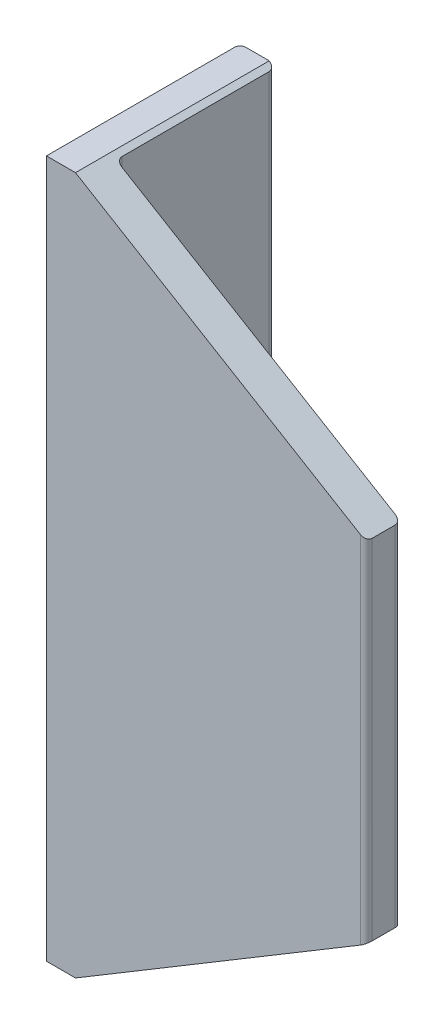
ISO-10303-21;
HEADER;
FILE_DESCRIPTION(('STEP AP214'),'2;1');
FILE_NAME('part.step','',(''),(''),'','','');
FILE_SCHEMA(('AUTOMOTIVE_DESIGN { 1 0 10303 214 1 1 1 1 }'));
ENDSEC;
DATA;
#1=APPLICATION_CONTEXT('core data for automotive mechanical design processes');
#2=APPLICATION_PROTOCOL_DEFINITION('international standard','automotive_design',2000,#1);
#3=PRODUCT_CONTEXT('',#1,'mechanical');
#4=PRODUCT('Part','Part','',(#3));
#5=PRODUCT_RELATED_PRODUCT_CATEGORY('part','',(#4));
#6=PRODUCT_DEFINITION_FORMATION('','',#4);
#7=PRODUCT_DEFINITION_CONTEXT('part definition',#1,'design');
#8=PRODUCT_DEFINITION('design','',#6,#7);
#9=PRODUCT_DEFINITION_SHAPE('','',#8);
#10=(LENGTH_UNIT() NAMED_UNIT(*) SI_UNIT(.MILLI.,.METRE.));
#11=(NAMED_UNIT(*) PLANE_ANGLE_UNIT() SI_UNIT($,.RADIAN.));
#12=(NAMED_UNIT(*) SI_UNIT($,.STERADIAN.) SOLID_ANGLE_UNIT());
#13=UNCERTAINTY_MEASURE_WITH_UNIT(LENGTH_MEASURE(1.E-05),#10,'distance_accuracy_value','');
#14=(GEOMETRIC_REPRESENTATION_CONTEXT(3) GLOBAL_UNCERTAINTY_ASSIGNED_CONTEXT((#13)) GLOBAL_UNIT_ASSIGNED_CONTEXT((#10,
#11,#12)) REPRESENTATION_CONTEXT('',''));
#15=CARTESIAN_POINT('',(0.,0.,0.));
#16=DIRECTION('',(0.,0.,1.));
#17=DIRECTION('',(1.,0.,0.));
#18=AXIS2_PLACEMENT_3D('',#15,#16,#17);
#19=CARTESIAN_POINT('',(-54.0165804389298,510.000098304883,19.1457703649463));
#20=DIRECTION('',(0.,0.,1.));
#21=DIRECTION('',(1.,0.,0.));
#22=AXIS2_PLACEMENT_3D('',#19,#20,#21);
#23=PLANE('',#22);
#24=DIRECTION('',(0.,-1.,0.));
#25=VECTOR('',#24,1.);
#26=CARTESIAN_POINT('',(298.48341956107,510.000098304883,19.1457703649463));
#27=LINE('',#26,#25);
#28=CARTESIAN_POINT('',(298.48341956107,37.5000983048829,19.1457703649463));
#29=VERTEX_POINT('',#28);
#30=CARTESIAN_POINT('',(298.48341956107,-169.499901695117,19.1457703649463));
#31=VERTEX_POINT('',#30);
#32=EDGE_CURVE('E212',#29,#31,#27,.T.);
#33=ORIENTED_EDGE('',*,*,#32,.T.);
#34=DIRECTION('',(-0.857492925712544,-0.514495755427526,0.));
#35=VECTOR('',#34,1.);
#36=CARTESIAN_POINT('',(339.071654855188,-145.146960518647,19.1457703649463));
#37=LINE('',#36,#35);
#38=CARTESIAN_POINT('',(-54.0165804389298,-380.999901695117,19.1457703649463));
#39=VERTEX_POINT('',#38);
#40=EDGE_CURVE('E238',#31,#39,#37,.T.);
#41=ORIENTED_EDGE('',*,*,#40,.T.);
#42=DIRECTION('',(0.,-1.,0.));
#43=VECTOR('',#42,1.);
#44=CARTESIAN_POINT('',(-54.0165804389298,510.000098304883,19.1457703649463));
#45=LINE('',#44,#43);
#46=CARTESIAN_POINT('',(-54.0165804389298,37.5000983048829,19.1457703649463));
#47=VERTEX_POINT('',#46);
#48=EDGE_CURVE('E209',#47,#39,#45,.T.);
#49=ORIENTED_EDGE('',*,*,#48,.F.);
#50=DIRECTION('',(-1.,0.,0.));
#51=VECTOR('',#50,1.);
#52=CARTESIAN_POINT('',(-54.0165804389298,37.5000983048829,19.1457703649463));
#53=LINE('',#52,#51);
#54=EDGE_CURVE('E267',#29,#47,#53,.T.);
#55=ORIENTED_EDGE('',*,*,#54,.F.);
#56=EDGE_LOOP('',(#33,#41,#49,#55));
#57=FACE_BOUND('',#56,.T.);
#58=ADVANCED_FACE('F39',(#57),#23,.F.);
#59=CARTESIAN_POINT('',(-54.0165804389298,510.000098304883,11.6457703649463));
#60=DIRECTION('',(0.,-1.,0.));
#61=DIRECTION('',(0.,0.,-1.));
#62=AXIS2_PLACEMENT_3D('',#59,#60,#61);
#63=CYLINDRICAL_SURFACE('',#62,7.5);
#64=ORIENTED_EDGE('',*,*,#48,.T.);
#65=CARTESIAN_POINT('',(-54.0165804389298,-380.999901695117,11.6457703649463));
#66=DIRECTION('',(-0.514495755427526,0.857492925712544,0.));
#67=DIRECTION('',(-0.857492925712544,-0.514495755427526,0.));
#68=AXIS2_PLACEMENT_3D('',#65,#66,#67);
#69=ELLIPSE('',#68,8.74642784226795,7.5);
#70=CARTESIAN_POINT('',(-61.5165804389298,-385.499901695117,11.6457703649463));
#71=VERTEX_POINT('',#70);
#72=EDGE_CURVE('E306',#39,#71,#69,.F.);
#73=ORIENTED_EDGE('',*,*,#72,.T.);
#74=DIRECTION('',(0.,-1.,0.));
#75=VECTOR('',#74,1.);
#76=CARTESIAN_POINT('',(-61.5165804389298,510.000098304883,11.6457703649463));
#77=LINE('',#76,#75);
#78=CARTESIAN_POINT('',(-61.5165804389298,37.5000983048829,11.6457703649463));
#79=VERTEX_POINT('',#78);
#80=EDGE_CURVE('E206',#79,#71,#77,.T.);
#81=ORIENTED_EDGE('',*,*,#80,.F.);
#82=CARTESIAN_POINT('',(-54.0165804389298,37.5000983048829,11.6457703649463));
#83=DIRECTION('',(0.,1.,0.));
#84=DIRECTION('',(0.,0.,1.));
#85=AXIS2_PLACEMENT_3D('',#82,#83,#84);
#86=CIRCLE('',#85,7.5);
#87=EDGE_CURVE('E265',#47,#79,#86,.F.);
#88=ORIENTED_EDGE('',*,*,#87,.F.);
#89=EDGE_LOOP('',(#64,#73,#81,#88));
#90=FACE_BOUND('',#89,.T.);
#91=ADVANCED_FACE('F317',(#90),#63,.F.);
#92=CARTESIAN_POINT('',(-61.5165804389299,510.000098304883,-178.354229635054));
#93=DIRECTION('',(-1.,0.,0.));
#94=DIRECTION('',(0.,0.,1.));
#95=AXIS2_PLACEMENT_3D('',#92,#93,#94);
#96=PLANE('',#95);
#97=ORIENTED_EDGE('',*,*,#80,.T.);
#98=DIRECTION('',(0.,0.,-1.));
#99=VECTOR('',#98,1.);
#100=CARTESIAN_POINT('',(-61.5165804389299,-385.499901695117,-178.354229635054));
#101=LINE('',#100,#99);
#102=CARTESIAN_POINT('',(-61.5165804389299,-385.499901695117,-178.354229635054));
#103=VERTEX_POINT('',#102);
#104=EDGE_CURVE('E172',#71,#103,#101,.T.);
#105=ORIENTED_EDGE('',*,*,#104,.T.);
#106=DIRECTION('',(0.,-1.,0.));
#107=VECTOR('',#106,1.);
#108=CARTESIAN_POINT('',(-61.5165804389299,510.000098304883,-178.354229635054));
#109=LINE('',#108,#107);
#110=CARTESIAN_POINT('',(-61.5165804389299,37.5000983048829,-178.354229635054));
#111=VERTEX_POINT('',#110);
#112=EDGE_CURVE('E171',#111,#103,#109,.T.);
#113=ORIENTED_EDGE('',*,*,#112,.F.);
#114=DIRECTION('',(0.,0.,-1.));
#115=VECTOR('',#114,1.);
#116=CARTESIAN_POINT('',(-61.5165804389299,37.5000983048829,-178.354229635054));
#117=LINE('',#116,#115);
#118=EDGE_CURVE('E262',#79,#111,#117,.T.);
#119=ORIENTED_EDGE('',*,*,#118,.F.);
#120=EDGE_LOOP('',(#97,#105,#113,#119));
#121=FACE_BOUND('',#120,.T.);
#122=ADVANCED_FACE('F324',(#121),#96,.F.);
#123=CARTESIAN_POINT('',(298.48341956107,510.000098304883,64.1457703649463));
#124=DIRECTION('',(0.,0.,-1.));
#125=DIRECTION('',(-1.,0.,0.));
#126=AXIS2_PLACEMENT_3D('',#123,#124,#125);
#127=PLANE('',#126);
#128=DIRECTION('',(1.,0.,0.));
#129=VECTOR('',#128,1.);
#130=CARTESIAN_POINT('',(298.48341956107,-389.999901695117,64.1457703649463));
#131=LINE('',#130,#129);
#132=CARTESIAN_POINT('',(-106.51658043893,-389.999901695117,64.1457703649463));
#133=VERTEX_POINT('',#132);
#134=CARTESIAN_POINT('',(-69.0165804389299,-389.999901695117,64.1457703649463));
#135=VERTEX_POINT('',#134);
#136=EDGE_CURVE('E187',#133,#135,#131,.T.);
#137=ORIENTED_EDGE('',*,*,#136,.T.);
#138=DIRECTION('',(-0.857492925712544,-0.514495755427526,0.));
#139=VECTOR('',#138,1.);
#140=CARTESIAN_POINT('',(-69.0165804389299,-389.999901695117,64.1457703649463));
#141=LINE('',#140,#139);
#142=CARTESIAN_POINT('',(298.48341956107,-169.499901695117,64.1457703649463));
#143=VERTEX_POINT('',#142);
#144=EDGE_CURVE('E54',#143,#135,#141,.T.);
#145=ORIENTED_EDGE('',*,*,#144,.F.);
#146=DIRECTION('',(0.,-1.,0.));
#147=VECTOR('',#146,1.);
#148=CARTESIAN_POINT('',(298.48341956107,510.000098304883,64.1457703649463));
#149=LINE('',#148,#147);
#150=CARTESIAN_POINT('',(298.48341956107,289.500098304883,64.1457703649463));
#151=VERTEX_POINT('',#150);
#152=EDGE_CURVE('E11',#151,#143,#149,.T.);
#153=ORIENTED_EDGE('',*,*,#152,.F.);
#154=DIRECTION('',(0.857492925712544,-0.514495755427526,0.));
#155=VECTOR('',#154,1.);
#156=CARTESIAN_POINT('',(-69.0165804389299,510.000098304883,64.1457703649463));
#157=LINE('',#156,#155);
#158=CARTESIAN_POINT('',(-69.0165804389299,510.000098304883,64.1457703649463));
#159=VERTEX_POINT('',#158);
#160=EDGE_CURVE('E232',#159,#151,#157,.T.);
#161=ORIENTED_EDGE('',*,*,#160,.F.);
#162=DIRECTION('',(1.,0.,0.));
#163=VECTOR('',#162,1.);
#164=CARTESIAN_POINT('',(298.48341956107,510.000098304883,64.1457703649463));
#165=LINE('',#164,#163);
#166=CARTESIAN_POINT('',(-106.51658043893,510.000098304883,64.1457703649463));
#167=VERTEX_POINT('',#166);
#168=EDGE_CURVE('E197',#167,#159,#165,.T.);
#169=ORIENTED_EDGE('',*,*,#168,.F.);
#170=DIRECTION('',(0.,-1.,0.));
#171=VECTOR('',#170,1.);
#172=CARTESIAN_POINT('',(-106.51658043893,510.000098304883,64.1457703649463));
#173=LINE('',#172,#171);
#174=EDGE_CURVE('E198',#167,#133,#173,.T.);
#175=ORIENTED_EDGE('',*,*,#174,.T.);
#176=EDGE_LOOP('',(#137,#145,#153,#161,#169,#175));
#177=FACE_BOUND('',#176,.T.);
#178=ADVANCED_FACE('F41',(#177),#127,.F.);
#179=CARTESIAN_POINT('',(298.48341956107,510.000098304883,56.6457703649463));
#180=DIRECTION('',(0.,-1.,0.));
#181=DIRECTION('',(0.,0.,-1.));
#182=AXIS2_PLACEMENT_3D('',#179,#180,#181);
#183=CYLINDRICAL_SURFACE('',#182,7.5);
#184=ORIENTED_EDGE('',*,*,#152,.T.);
#185=CARTESIAN_POINT('',(298.48341956107,-169.499901695117,56.6457703649463));
#186=DIRECTION('',(-0.514495755427526,0.857492925712544,0.));
#187=DIRECTION('',(-0.857492925712544,-0.514495755427526,0.));
#188=AXIS2_PLACEMENT_3D('',#185,#186,#187);
#189=ELLIPSE('',#188,8.74642784226795,7.5);
#190=CARTESIAN_POINT('',(305.98341956107,-164.999901695117,56.6457703649463));
#191=VERTEX_POINT('',#190);
#192=EDGE_CURVE('E231',#143,#191,#189,.T.);
#193=ORIENTED_EDGE('',*,*,#192,.T.);
#194=DIRECTION('',(0.,-1.,0.));
#195=VECTOR('',#194,1.);
#196=CARTESIAN_POINT('',(305.98341956107,510.000098304883,56.6457703649463));
#197=LINE('',#196,#195);
#198=CARTESIAN_POINT('',(305.98341956107,285.000098304883,56.6457703649463));
#199=VERTEX_POINT('',#198);
#200=EDGE_CURVE('E47',#199,#191,#197,.T.);
#201=ORIENTED_EDGE('',*,*,#200,.F.);
#202=CARTESIAN_POINT('',(298.48341956107,289.500098304883,56.6457703649463));
#203=DIRECTION('',(-0.514495755427526,-0.857492925712544,0.));
#204=DIRECTION('',(0.857492925712544,-0.514495755427526,0.));
#205=AXIS2_PLACEMENT_3D('',#202,#203,#204);
#206=ELLIPSE('',#205,8.74642784226795,7.5);
#207=EDGE_CURVE('E229',#199,#151,#206,.T.);
#208=ORIENTED_EDGE('',*,*,#207,.T.);
#209=EDGE_LOOP('',(#184,#193,#201,#208));
#210=FACE_BOUND('',#209,.T.);
#211=ADVANCED_FACE('F228',(#210),#183,.T.);
#212=CARTESIAN_POINT('',(305.98341956107,510.000098304883,26.6457703649463));
#213=DIRECTION('',(-1.,0.,0.));
#214=DIRECTION('',(0.,0.,1.));
#215=AXIS2_PLACEMENT_3D('',#212,#213,#214);
#216=PLANE('',#215);
#217=ORIENTED_EDGE('',*,*,#200,.T.);
#218=DIRECTION('',(0.,0.,1.));
#219=VECTOR('',#218,1.);
#220=CARTESIAN_POINT('',(305.98341956107,-164.999901695117,-185.854229635054));
#221=LINE('',#220,#219);
#222=CARTESIAN_POINT('',(305.98341956107,-164.999901695117,26.6457703649463));
#223=VERTEX_POINT('',#222);
#224=EDGE_CURVE('E159',#223,#191,#221,.T.);
#225=ORIENTED_EDGE('',*,*,#224,.F.);
#226=DIRECTION('',(0.,-1.,0.));
#227=VECTOR('',#226,1.);
#228=CARTESIAN_POINT('',(305.98341956107,510.000098304883,26.6457703649463));
#229=LINE('',#228,#227);
#230=CARTESIAN_POINT('',(305.98341956107,285.000098304883,26.6457703649463));
#231=VERTEX_POINT('',#230);
#232=EDGE_CURVE('E215',#231,#223,#229,.T.);
#233=ORIENTED_EDGE('',*,*,#232,.F.);
#234=DIRECTION('',(0.,0.,1.));
#235=VECTOR('',#234,1.);
#236=CARTESIAN_POINT('',(305.98341956107,285.000098304883,-185.854229635054));
#237=LINE('',#236,#235);
#238=EDGE_CURVE('E224',#231,#199,#237,.T.);
#239=ORIENTED_EDGE('',*,*,#238,.T.);
#240=EDGE_LOOP('',(#217,#225,#233,#239));
#241=FACE_BOUND('',#240,.T.);
#242=ADVANCED_FACE('F222',(#241),#216,.F.);
#243=CARTESIAN_POINT('',(298.48341956107,510.000098304883,26.6457703649463));
#244=DIRECTION('',(0.,-1.,0.));
#245=DIRECTION('',(0.,0.,-1.));
#246=AXIS2_PLACEMENT_3D('',#243,#244,#245);
#247=CYLINDRICAL_SURFACE('',#246,7.5);
#248=ORIENTED_EDGE('',*,*,#232,.T.);
#249=CARTESIAN_POINT('',(298.48341956107,-169.499901695117,26.6457703649463));
#250=DIRECTION('',(-0.514495755427526,0.857492925712544,0.));
#251=DIRECTION('',(-0.857492925712544,-0.514495755427526,0.));
#252=AXIS2_PLACEMENT_3D('',#249,#250,#251);
#253=ELLIPSE('',#252,8.74642784226795,7.5);
#254=EDGE_CURVE('E233',#223,#31,#253,.T.);
#255=ORIENTED_EDGE('',*,*,#254,.T.);
#256=ORIENTED_EDGE('',*,*,#32,.F.);
#257=DIRECTION('',(0.,-1.,0.));
#258=VECTOR('',#257,1.);
#259=CARTESIAN_POINT('',(298.48341956107,510.000098304883,19.1457703649463));
#260=LINE('',#259,#258);
#261=CARTESIAN_POINT('',(298.48341956107,82.5000983048829,19.1457703649463));
#262=VERTEX_POINT('',#261);
#263=EDGE_CURVE('E191',#29,#262,#260,.F.);
#264=ORIENTED_EDGE('',*,*,#263,.T.);
#265=CARTESIAN_POINT('',(298.48341956107,289.500098304883,19.1457703649463));
#266=VERTEX_POINT('',#265);
#267=EDGE_CURVE('E213',#266,#262,#27,.T.);
#268=ORIENTED_EDGE('',*,*,#267,.F.);
#269=CARTESIAN_POINT('',(298.48341956107,289.500098304883,26.6457703649463));
#270=DIRECTION('',(-0.514495755427526,-0.857492925712544,0.));
#271=DIRECTION('',(0.857492925712544,-0.514495755427526,0.));
#272=AXIS2_PLACEMENT_3D('',#269,#270,#271);
#273=ELLIPSE('',#272,8.74642784226795,7.5);
#274=EDGE_CURVE('E255',#266,#231,#273,.T.);
#275=ORIENTED_EDGE('',*,*,#274,.T.);
#276=EDGE_LOOP('',(#248,#255,#256,#264,#268,#275));
#277=FACE_BOUND('',#276,.T.);
#278=ADVANCED_FACE('F343',(#277),#247,.T.);
#279=CARTESIAN_POINT('',(-54.0165804389298,501.000098304883,19.1457703649463));
#280=VERTEX_POINT('',#279);
#281=CARTESIAN_POINT('',(-54.0165804389298,82.5000983048829,19.1457703649463));
#282=VERTEX_POINT('',#281);
#283=EDGE_CURVE('E210',#280,#282,#45,.T.);
#284=ORIENTED_EDGE('',*,*,#283,.F.);
#285=DIRECTION('',(0.857492925712544,-0.514495755427526,0.));
#286=VECTOR('',#285,1.);
#287=CARTESIAN_POINT('',(-57.9871686742239,503.382451246059,19.1457703649463));
#288=LINE('',#287,#286);
#289=EDGE_CURVE('E252',#280,#266,#288,.T.);
#290=ORIENTED_EDGE('',*,*,#289,.T.);
#291=ORIENTED_EDGE('',*,*,#267,.T.);
#292=DIRECTION('',(-1.,0.,0.));
#293=VECTOR('',#292,1.);
#294=CARTESIAN_POINT('',(-54.0165804389298,82.5000983048829,19.1457703649463));
#295=LINE('',#294,#293);
#296=EDGE_CURVE('E275',#262,#282,#295,.T.);
#297=ORIENTED_EDGE('',*,*,#296,.T.);
#298=EDGE_LOOP('',(#284,#290,#291,#297));
#299=FACE_BOUND('',#298,.T.);
#300=ADVANCED_FACE('F340',(#299),#23,.F.);
#301=CARTESIAN_POINT('',(-61.5165804389298,505.500098304883,11.6457703649463));
#302=VERTEX_POINT('',#301);
#303=CARTESIAN_POINT('',(-61.5165804389298,82.5000983048829,11.6457703649463));
#304=VERTEX_POINT('',#303);
#305=EDGE_CURVE('E207',#302,#304,#77,.T.);
#306=ORIENTED_EDGE('',*,*,#305,.F.);
#307=CARTESIAN_POINT('',(-54.0165804389298,501.000098304883,11.6457703649463));
#308=DIRECTION('',(-0.514495755427526,-0.857492925712544,0.));
#309=DIRECTION('',(0.857492925712544,-0.514495755427526,0.));
#310=AXIS2_PLACEMENT_3D('',#307,#308,#309);
#311=ELLIPSE('',#310,8.74642784226795,7.5);
#312=EDGE_CURVE('E249',#302,#280,#311,.F.);
#313=ORIENTED_EDGE('',*,*,#312,.T.);
#314=ORIENTED_EDGE('',*,*,#283,.T.);
#315=CARTESIAN_POINT('',(-54.0165804389298,82.5000983048829,11.6457703649463));
#316=DIRECTION('',(0.,1.,0.));
#317=DIRECTION('',(0.,0.,1.));
#318=AXIS2_PLACEMENT_3D('',#315,#316,#317);
#319=CIRCLE('',#318,7.5);
#320=EDGE_CURVE('E272',#282,#304,#319,.F.);
#321=ORIENTED_EDGE('',*,*,#320,.T.);
#322=EDGE_LOOP('',(#306,#313,#314,#321));
#323=FACE_BOUND('',#322,.T.);
#324=ADVANCED_FACE('F337',(#323),#63,.F.);
#325=CARTESIAN_POINT('',(-61.5165804389299,505.500098304883,-178.354229635054));
#326=VERTEX_POINT('',#325);
#327=CARTESIAN_POINT('',(-61.5165804389299,82.5000983048829,-178.354229635054));
#328=VERTEX_POINT('',#327);
#329=EDGE_CURVE('E204',#326,#328,#109,.T.);
#330=ORIENTED_EDGE('',*,*,#329,.F.);
#331=DIRECTION('',(0.,0.,1.));
#332=VECTOR('',#331,1.);
#333=CARTESIAN_POINT('',(-61.5165804389299,505.500098304883,-178.354229635054));
#334=LINE('',#333,#332);
#335=EDGE_CURVE('E246',#326,#302,#334,.T.);
#336=ORIENTED_EDGE('',*,*,#335,.T.);
#337=ORIENTED_EDGE('',*,*,#305,.T.);
#338=DIRECTION('',(0.,0.,-1.));
#339=VECTOR('',#338,1.);
#340=CARTESIAN_POINT('',(-61.5165804389299,82.5000983048829,-178.354229635054));
#341=LINE('',#340,#339);
#342=EDGE_CURVE('E269',#304,#328,#341,.T.);
#343=ORIENTED_EDGE('',*,*,#342,.T.);
#344=EDGE_LOOP('',(#330,#336,#337,#343));
#345=FACE_BOUND('',#344,.T.);
#346=ADVANCED_FACE('F334',(#345),#96,.F.);
#347=CARTESIAN_POINT('',(-69.0165804389299,510.000098304883,-178.354229635054));
#348=DIRECTION('',(0.,-1.,0.));
#349=DIRECTION('',(0.,0.,-1.));
#350=AXIS2_PLACEMENT_3D('',#347,#348,#349);
#351=CYLINDRICAL_SURFACE('',#350,7.5);
#352=ORIENTED_EDGE('',*,*,#112,.T.);
#353=CARTESIAN_POINT('',(-69.0165804389299,-389.999901695117,-178.354229635054));
#354=DIRECTION('',(-0.514495755427526,0.857492925712544,0.));
#355=DIRECTION('',(-0.857492925712544,-0.514495755427526,0.));
#356=AXIS2_PLACEMENT_3D('',#353,#354,#355);
#357=ELLIPSE('',#356,8.74642784226795,7.5);
#358=CARTESIAN_POINT('',(-69.0165804389299,-389.999901695117,-185.854229635054));
#359=VERTEX_POINT('',#358);
#360=EDGE_CURVE('E153',#103,#359,#357,.T.);
#361=ORIENTED_EDGE('',*,*,#360,.T.);
#362=DIRECTION('',(0.,-1.,0.));
#363=VECTOR('',#362,1.);
#364=CARTESIAN_POINT('',(-69.0165804389299,510.000098304883,-185.854229635054));
#365=LINE('',#364,#363);
#366=CARTESIAN_POINT('',(-69.0165804389299,510.000098304883,-185.854229635054));
#367=VERTEX_POINT('',#366);
#368=EDGE_CURVE('E167',#367,#359,#365,.T.);
#369=ORIENTED_EDGE('',*,*,#368,.F.);
#370=CARTESIAN_POINT('',(-69.0165804389299,510.000098304883,-178.354229635054));
#371=DIRECTION('',(-0.514495755427526,-0.857492925712544,0.));
#372=DIRECTION('',(0.857492925712544,-0.514495755427526,0.));
#373=AXIS2_PLACEMENT_3D('',#370,#371,#372);
#374=ELLIPSE('',#373,8.74642784226795,7.5);
#375=EDGE_CURVE('E243',#367,#326,#374,.T.);
#376=ORIENTED_EDGE('',*,*,#375,.T.);
#377=ORIENTED_EDGE('',*,*,#329,.T.);
#378=DIRECTION('',(0.,-1.,0.));
#379=VECTOR('',#378,1.);
#380=CARTESIAN_POINT('',(-61.5165804389299,510.000098304883,-178.354229635054));
#381=LINE('',#380,#379);
#382=EDGE_CURVE('E278',#328,#111,#381,.T.);
#383=ORIENTED_EDGE('',*,*,#382,.T.);
#384=EDGE_LOOP('',(#352,#361,#369,#376,#377,#383));
#385=FACE_BOUND('',#384,.T.);
#386=ADVANCED_FACE('F165',(#385),#351,.T.);
#387=CARTESIAN_POINT('',(-99.0165804389299,510.000098304883,-185.854229635054));
#388=DIRECTION('',(0.,0.,1.));
#389=DIRECTION('',(1.,0.,0.));
#390=AXIS2_PLACEMENT_3D('',#387,#388,#389);
#391=PLANE('',#390);
#392=DIRECTION('',(-1.,0.,0.));
#393=VECTOR('',#392,1.);
#394=CARTESIAN_POINT('',(-99.0165804389299,-389.999901695117,-185.854229635054));
#395=LINE('',#394,#393);
#396=CARTESIAN_POINT('',(-99.0165804389299,-389.999901695117,-185.854229635054));
#397=VERTEX_POINT('',#396);
#398=EDGE_CURVE('E178',#359,#397,#395,.T.);
#399=ORIENTED_EDGE('',*,*,#398,.T.);
#400=DIRECTION('',(0.,-1.,0.));
#401=VECTOR('',#400,1.);
#402=CARTESIAN_POINT('',(-99.0165804389299,510.000098304883,-185.854229635054));
#403=LINE('',#402,#401);
#404=CARTESIAN_POINT('',(-99.0165804389299,510.000098304883,-185.854229635054));
#405=VERTEX_POINT('',#404);
#406=EDGE_CURVE('E181',#405,#397,#403,.T.);
#407=ORIENTED_EDGE('',*,*,#406,.F.);
#408=DIRECTION('',(-1.,0.,0.));
#409=VECTOR('',#408,1.);
#410=CARTESIAN_POINT('',(-99.0165804389299,510.000098304883,-185.854229635054));
#411=LINE('',#410,#409);
#412=EDGE_CURVE('E180',#367,#405,#411,.T.);
#413=ORIENTED_EDGE('',*,*,#412,.F.);
#414=ORIENTED_EDGE('',*,*,#368,.T.);
#415=EDGE_LOOP('',(#399,#407,#413,#414));
#416=FACE_BOUND('',#415,.T.);
#417=ADVANCED_FACE('F176',(#416),#391,.F.);
#418=CARTESIAN_POINT('',(-99.0165804389299,510.000098304883,-178.354229635054));
#419=DIRECTION('',(0.,-1.,0.));
#420=DIRECTION('',(0.,0.,-1.));
#421=AXIS2_PLACEMENT_3D('',#418,#419,#420);
#422=CYLINDRICAL_SURFACE('',#421,7.5);
#423=ORIENTED_EDGE('',*,*,#406,.T.);
#424=CARTESIAN_POINT('',(-99.0165804389299,-389.999901695117,-178.354229635054));
#425=DIRECTION('',(0.,1.,0.));
#426=DIRECTION('',(0.,0.,-1.));
#427=AXIS2_PLACEMENT_3D('',#424,#425,#426);
#428=CIRCLE('',#427,7.5);
#429=CARTESIAN_POINT('',(-106.51658043893,-389.999901695117,-178.354229635054));
#430=VERTEX_POINT('',#429);
#431=EDGE_CURVE('E186',#397,#430,#428,.T.);
#432=ORIENTED_EDGE('',*,*,#431,.T.);
#433=DIRECTION('',(0.,-1.,0.));
#434=VECTOR('',#433,1.);
#435=CARTESIAN_POINT('',(-106.51658043893,510.000098304883,-178.354229635054));
#436=LINE('',#435,#434);
#437=CARTESIAN_POINT('',(-106.51658043893,510.000098304883,-178.354229635054));
#438=VERTEX_POINT('',#437);
#439=EDGE_CURVE('E200',#438,#430,#436,.T.);
#440=ORIENTED_EDGE('',*,*,#439,.F.);
#441=CARTESIAN_POINT('',(-99.0165804389299,510.000098304883,-178.354229635054));
#442=DIRECTION('',(0.,1.,0.));
#443=DIRECTION('',(0.,0.,-1.));
#444=AXIS2_PLACEMENT_3D('',#441,#442,#443);
#445=CIRCLE('',#444,7.5);
#446=EDGE_CURVE('E285',#405,#438,#445,.T.);
#447=ORIENTED_EDGE('',*,*,#446,.F.);
#448=EDGE_LOOP('',(#423,#432,#440,#447));
#449=FACE_BOUND('',#448,.T.);
#450=ADVANCED_FACE('F301',(#449),#422,.T.);
#451=CARTESIAN_POINT('',(-106.51658043893,510.000098304883,64.1457703649463));
#452=DIRECTION('',(1.,0.,0.));
#453=DIRECTION('',(0.,0.,-1.));
#454=AXIS2_PLACEMENT_3D('',#451,#452,#453);
#455=PLANE('',#454);
#456=ORIENTED_EDGE('',*,*,#439,.T.);
#457=DIRECTION('',(0.,0.,1.));
#458=VECTOR('',#457,1.);
#459=CARTESIAN_POINT('',(-106.51658043893,-389.999901695117,64.1457703649463));
#460=LINE('',#459,#458);
#461=EDGE_CURVE('E189',#430,#133,#460,.T.);
#462=ORIENTED_EDGE('',*,*,#461,.T.);
#463=ORIENTED_EDGE('',*,*,#174,.F.);
#464=DIRECTION('',(0.,0.,1.));
#465=VECTOR('',#464,1.);
#466=CARTESIAN_POINT('',(-106.51658043893,510.000098304883,64.1457703649463));
#467=LINE('',#466,#465);
#468=EDGE_CURVE('E201',#438,#167,#467,.T.);
#469=ORIENTED_EDGE('',*,*,#468,.F.);
#470=EDGE_LOOP('',(#456,#462,#463,#469));
#471=FACE_BOUND('',#470,.T.);
#472=ADVANCED_FACE('F295',(#471),#455,.F.);
#473=CARTESIAN_POINT('',(-99.0165804389299,510.000098304883,-178.354229635054));
#474=DIRECTION('',(0.,-1.,0.));
#475=DIRECTION('',(0.,0.,-1.));
#476=AXIS2_PLACEMENT_3D('',#473,#474,#475);
#477=PLANE('',#476);
#478=ORIENTED_EDGE('',*,*,#168,.T.);
#479=DIRECTION('',(0.,0.,1.));
#480=VECTOR('',#479,1.);
#481=CARTESIAN_POINT('',(-69.0165804389299,510.000098304883,-185.854229635054));
#482=LINE('',#481,#480);
#483=EDGE_CURVE('E235',#367,#159,#482,.T.);
#484=ORIENTED_EDGE('',*,*,#483,.F.);
#485=ORIENTED_EDGE('',*,*,#412,.T.);
#486=ORIENTED_EDGE('',*,*,#446,.T.);
#487=ORIENTED_EDGE('',*,*,#468,.T.);
#488=EDGE_LOOP('',(#478,#484,#485,#486,#487));
#489=FACE_BOUND('',#488,.T.);
#490=ADVANCED_FACE('F289',(#489),#477,.F.);
#491=CARTESIAN_POINT('',(-99.0165804389299,-389.999901695117,-178.354229635054));
#492=DIRECTION('',(0.,-1.,0.));
#493=DIRECTION('',(0.,0.,-1.));
#494=AXIS2_PLACEMENT_3D('',#491,#492,#493);
#495=PLANE('',#494);
#496=DIRECTION('',(0.,0.,1.));
#497=VECTOR('',#496,1.);
#498=CARTESIAN_POINT('',(-69.0165804389299,-389.999901695117,-185.854229635054));
#499=LINE('',#498,#497);
#500=EDGE_CURVE('E150',#359,#135,#499,.T.);
#501=ORIENTED_EDGE('',*,*,#500,.T.);
#502=ORIENTED_EDGE('',*,*,#136,.F.);
#503=ORIENTED_EDGE('',*,*,#461,.F.);
#504=ORIENTED_EDGE('',*,*,#431,.F.);
#505=ORIENTED_EDGE('',*,*,#398,.F.);
#506=EDGE_LOOP('',(#501,#502,#503,#504,#505));
#507=FACE_BOUND('',#506,.T.);
#508=ADVANCED_FACE('F183',(#507),#495,.T.);
#509=CARTESIAN_POINT('',(-61.5165804389299,60.0000983048829,-178.354229635054));
#510=DIRECTION('',(-0.480983596396202,0.,0.876729593431051));
#511=DIRECTION('',(0.876729593431051,0.,0.480983596396202));
#512=AXIS2_PLACEMENT_3D('',#509,#510,#511);
#513=PLANE('',#512);
#514=ORIENTED_EDGE('',*,*,#263,.F.);
#515=DIRECTION('',(0.876729593431051,0.,0.480983596396202));
#516=VECTOR('',#515,1.);
#517=CARTESIAN_POINT('',(-61.5165804389299,37.5000983048829,-178.354229635054));
#518=LINE('',#517,#516);
#519=EDGE_CURVE('E62',#111,#29,#518,.T.);
#520=ORIENTED_EDGE('',*,*,#519,.F.);
#521=ORIENTED_EDGE('',*,*,#382,.F.);
#522=DIRECTION('',(0.876729593431051,0.,0.480983596396202));
#523=VECTOR('',#522,1.);
#524=CARTESIAN_POINT('',(-61.5165804389299,82.5000983048829,-178.354229635054));
#525=LINE('',#524,#523);
#526=EDGE_CURVE('E259',#328,#262,#525,.T.);
#527=ORIENTED_EDGE('',*,*,#526,.T.);
#528=EDGE_LOOP('',(#514,#520,#521,#527));
#529=FACE_BOUND('',#528,.T.);
#530=ADVANCED_FACE('F327',(#529),#513,.F.);
#531=CARTESIAN_POINT('',(99.7334195610701,82.5000983048829,-60.8542296350537));
#532=DIRECTION('',(0.,1.,0.));
#533=DIRECTION('',(0.,0.,1.));
#534=AXIS2_PLACEMENT_3D('',#531,#532,#533);
#535=PLANE('',#534);
#536=ORIENTED_EDGE('',*,*,#296,.F.);
#537=ORIENTED_EDGE('',*,*,#526,.F.);
#538=ORIENTED_EDGE('',*,*,#342,.F.);
#539=ORIENTED_EDGE('',*,*,#320,.F.);
#540=EDGE_LOOP('',(#536,#537,#538,#539));
#541=FACE_BOUND('',#540,.T.);
#542=ADVANCED_FACE('F331',(#541),#535,.T.);
#543=CARTESIAN_POINT('',(99.7334195610701,37.5000983048829,-60.8542296350537));
#544=DIRECTION('',(0.,1.,0.));
#545=DIRECTION('',(0.,0.,1.));
#546=AXIS2_PLACEMENT_3D('',#543,#544,#545);
#547=PLANE('',#546);
#548=ORIENTED_EDGE('',*,*,#519,.T.);
#549=ORIENTED_EDGE('',*,*,#54,.T.);
#550=ORIENTED_EDGE('',*,*,#87,.T.);
#551=ORIENTED_EDGE('',*,*,#118,.T.);
#552=EDGE_LOOP('',(#548,#549,#550,#551));
#553=FACE_BOUND('',#552,.T.);
#554=ADVANCED_FACE('F322',(#553),#547,.F.);
#555=CARTESIAN_POINT('',(-69.0165804389299,510.000098304883,-185.854229635054));
#556=DIRECTION('',(-0.514495755427526,-0.857492925712544,0.));
#557=DIRECTION('',(0.857492925712544,-0.514495755427526,0.));
#558=AXIS2_PLACEMENT_3D('',#555,#556,#557);
#559=PLANE('',#558);
#560=ORIENTED_EDGE('',*,*,#238,.F.);
#561=ORIENTED_EDGE('',*,*,#274,.F.);
#562=ORIENTED_EDGE('',*,*,#289,.F.);
#563=ORIENTED_EDGE('',*,*,#312,.F.);
#564=ORIENTED_EDGE('',*,*,#335,.F.);
#565=ORIENTED_EDGE('',*,*,#375,.F.);
#566=ORIENTED_EDGE('',*,*,#483,.T.);
#567=ORIENTED_EDGE('',*,*,#160,.T.);
#568=ORIENTED_EDGE('',*,*,#207,.F.);
#569=EDGE_LOOP('',(#560,#561,#562,#563,#564,#565,#566,#567,#568));
#570=FACE_BOUND('',#569,.T.);
#571=ADVANCED_FACE('F299',(#570),#559,.F.);
#572=CARTESIAN_POINT('',(-69.0165804389299,-389.999901695117,-185.854229635054));
#573=DIRECTION('',(-0.514495755427526,0.857492925712544,0.));
#574=DIRECTION('',(-0.857492925712544,-0.514495755427526,0.));
#575=AXIS2_PLACEMENT_3D('',#572,#573,#574);
#576=PLANE('',#575);
#577=ORIENTED_EDGE('',*,*,#144,.T.);
#578=ORIENTED_EDGE('',*,*,#500,.F.);
#579=ORIENTED_EDGE('',*,*,#360,.F.);
#580=ORIENTED_EDGE('',*,*,#104,.F.);
#581=ORIENTED_EDGE('',*,*,#72,.F.);
#582=ORIENTED_EDGE('',*,*,#40,.F.);
#583=ORIENTED_EDGE('',*,*,#254,.F.);
#584=ORIENTED_EDGE('',*,*,#224,.T.);
#585=ORIENTED_EDGE('',*,*,#192,.F.);
#586=EDGE_LOOP('',(#577,#578,#579,#580,#581,#582,#583,#584,#585));
#587=FACE_BOUND('',#586,.T.);
#588=ADVANCED_FACE('F152',(#587),#576,.F.);
#589=CLOSED_SHELL('',(#58,#91,#122,#178,#211,#242,#278,#300,#324,#346,#386,#417,#450,#472,#490,
#508,#530,#542,#554,#571,#588));
#590=MANIFOLD_SOLID_BREP('B2',#589);
#591=ADVANCED_BREP_SHAPE_REPRESENTATION('',(#18,#590),#14);
#592=SHAPE_DEFINITION_REPRESENTATION(#9,#591);
ENDSEC;
END-ISO-10303-21;
